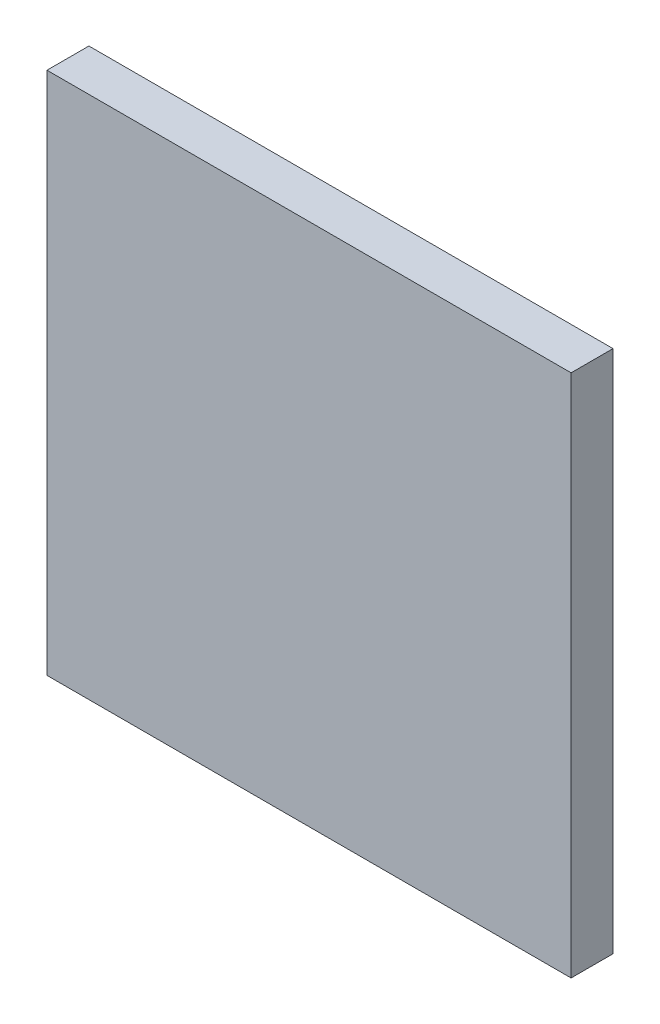
ISO-10303-21;
HEADER;
FILE_DESCRIPTION(('STEP AP214'),'2;1');
FILE_NAME('part.step','',(''),(''),'','','');
FILE_SCHEMA(('AUTOMOTIVE_DESIGN { 1 0 10303 214 1 1 1 1 }'));
ENDSEC;
DATA;
#1=APPLICATION_CONTEXT('core data for automotive mechanical design processes');
#2=APPLICATION_PROTOCOL_DEFINITION('international standard','automotive_design',2000,#1);
#3=PRODUCT_CONTEXT('',#1,'mechanical');
#4=PRODUCT('Part','Part','',(#3));
#5=PRODUCT_RELATED_PRODUCT_CATEGORY('part','',(#4));
#6=PRODUCT_DEFINITION_FORMATION('','',#4);
#7=PRODUCT_DEFINITION_CONTEXT('part definition',#1,'design');
#8=PRODUCT_DEFINITION('design','',#6,#7);
#9=PRODUCT_DEFINITION_SHAPE('','',#8);
#10=(LENGTH_UNIT() NAMED_UNIT(*) SI_UNIT(.MILLI.,.METRE.));
#11=(NAMED_UNIT(*) PLANE_ANGLE_UNIT() SI_UNIT($,.RADIAN.));
#12=(NAMED_UNIT(*) SI_UNIT($,.STERADIAN.) SOLID_ANGLE_UNIT());
#13=UNCERTAINTY_MEASURE_WITH_UNIT(LENGTH_MEASURE(1.E-05),#10,'distance_accuracy_value','');
#14=(GEOMETRIC_REPRESENTATION_CONTEXT(3) GLOBAL_UNCERTAINTY_ASSIGNED_CONTEXT((#13)) GLOBAL_UNIT_ASSIGNED_CONTEXT((#10,
#11,#12)) REPRESENTATION_CONTEXT('',''));
#15=CARTESIAN_POINT('',(0.,0.,0.));
#16=DIRECTION('',(0.,0.,1.));
#17=DIRECTION('',(1.,0.,0.));
#18=AXIS2_PLACEMENT_3D('',#15,#16,#17);
#19=CARTESIAN_POINT('',(0.,0.,4.));
#20=DIRECTION('',(1.,0.,0.));
#21=DIRECTION('',(0.,0.,-1.));
#22=AXIS2_PLACEMENT_3D('',#19,#20,#21);
#23=PLANE('',#22);
#24=DIRECTION('',(0.,-1.,0.));
#25=VECTOR('',#24,1.);
#26=CARTESIAN_POINT('',(0.,0.,0.));
#27=LINE('',#26,#25);
#28=CARTESIAN_POINT('',(0.,50.,0.));
#29=VERTEX_POINT('',#28);
#30=CARTESIAN_POINT('',(0.,0.,0.));
#31=VERTEX_POINT('',#30);
#32=EDGE_CURVE('E98',#29,#31,#27,.T.);
#33=ORIENTED_EDGE('',*,*,#32,.T.);
#34=DIRECTION('',(0.,0.,-1.));
#35=VECTOR('',#34,1.);
#36=CARTESIAN_POINT('',(0.,0.,4.));
#37=LINE('',#36,#35);
#38=CARTESIAN_POINT('',(0.,0.,4.));
#39=VERTEX_POINT('',#38);
#40=EDGE_CURVE('E11',#39,#31,#37,.T.);
#41=ORIENTED_EDGE('',*,*,#40,.F.);
#42=DIRECTION('',(0.,-1.,0.));
#43=VECTOR('',#42,1.);
#44=CARTESIAN_POINT('',(0.,0.,4.));
#45=LINE('',#44,#43);
#46=CARTESIAN_POINT('',(0.,50.,4.));
#47=VERTEX_POINT('',#46);
#48=EDGE_CURVE('E86',#47,#39,#45,.T.);
#49=ORIENTED_EDGE('',*,*,#48,.F.);
#50=DIRECTION('',(0.,0.,-1.));
#51=VECTOR('',#50,1.);
#52=CARTESIAN_POINT('',(0.,50.,4.));
#53=LINE('',#52,#51);
#54=EDGE_CURVE('E94',#47,#29,#53,.T.);
#55=ORIENTED_EDGE('',*,*,#54,.T.);
#56=EDGE_LOOP('',(#33,#41,#49,#55));
#57=FACE_BOUND('',#56,.T.);
#58=ADVANCED_FACE('F35',(#57),#23,.F.);
#59=CARTESIAN_POINT('',(0.,0.,4.));
#60=DIRECTION('',(0.,1.,0.));
#61=DIRECTION('',(0.,0.,1.));
#62=AXIS2_PLACEMENT_3D('',#59,#60,#61);
#63=PLANE('',#62);
#64=DIRECTION('',(1.,0.,0.));
#65=VECTOR('',#64,1.);
#66=CARTESIAN_POINT('',(0.,0.,0.));
#67=LINE('',#66,#65);
#68=CARTESIAN_POINT('',(50.,0.,0.));
#69=VERTEX_POINT('',#68);
#70=EDGE_CURVE('E90',#31,#69,#67,.T.);
#71=ORIENTED_EDGE('',*,*,#70,.T.);
#72=DIRECTION('',(0.,0.,-1.));
#73=VECTOR('',#72,1.);
#74=CARTESIAN_POINT('',(50.,0.,4.));
#75=LINE('',#74,#73);
#76=CARTESIAN_POINT('',(50.,0.,4.));
#77=VERTEX_POINT('',#76);
#78=EDGE_CURVE('E43',#77,#69,#75,.T.);
#79=ORIENTED_EDGE('',*,*,#78,.F.);
#80=DIRECTION('',(1.,0.,0.));
#81=VECTOR('',#80,1.);
#82=CARTESIAN_POINT('',(0.,0.,4.));
#83=LINE('',#82,#81);
#84=EDGE_CURVE('E81',#39,#77,#83,.T.);
#85=ORIENTED_EDGE('',*,*,#84,.F.);
#86=ORIENTED_EDGE('',*,*,#40,.T.);
#87=EDGE_LOOP('',(#71,#79,#85,#86));
#88=FACE_BOUND('',#87,.T.);
#89=ADVANCED_FACE('F89',(#88),#63,.F.);
#90=CARTESIAN_POINT('',(50.,0.,4.));
#91=DIRECTION('',(-1.,0.,0.));
#92=DIRECTION('',(0.,0.,1.));
#93=AXIS2_PLACEMENT_3D('',#90,#91,#92);
#94=PLANE('',#93);
#95=DIRECTION('',(0.,1.,0.));
#96=VECTOR('',#95,1.);
#97=CARTESIAN_POINT('',(50.,0.,0.));
#98=LINE('',#97,#96);
#99=CARTESIAN_POINT('',(50.,50.,0.));
#100=VERTEX_POINT('',#99);
#101=EDGE_CURVE('E68',#69,#100,#98,.T.);
#102=ORIENTED_EDGE('',*,*,#101,.T.);
#103=DIRECTION('',(0.,0.,-1.));
#104=VECTOR('',#103,1.);
#105=CARTESIAN_POINT('',(50.,50.,4.));
#106=LINE('',#105,#104);
#107=CARTESIAN_POINT('',(50.,50.,4.));
#108=VERTEX_POINT('',#107);
#109=EDGE_CURVE('E91',#108,#100,#106,.T.);
#110=ORIENTED_EDGE('',*,*,#109,.F.);
#111=DIRECTION('',(0.,1.,0.));
#112=VECTOR('',#111,1.);
#113=CARTESIAN_POINT('',(50.,0.,4.));
#114=LINE('',#113,#112);
#115=EDGE_CURVE('E84',#77,#108,#114,.T.);
#116=ORIENTED_EDGE('',*,*,#115,.F.);
#117=ORIENTED_EDGE('',*,*,#78,.T.);
#118=EDGE_LOOP('',(#102,#110,#116,#117));
#119=FACE_BOUND('',#118,.T.);
#120=ADVANCED_FACE('F92',(#119),#94,.F.);
#121=CARTESIAN_POINT('',(0.,50.,4.));
#122=DIRECTION('',(0.,-1.,0.));
#123=DIRECTION('',(0.,0.,-1.));
#124=AXIS2_PLACEMENT_3D('',#121,#122,#123);
#125=PLANE('',#124);
#126=DIRECTION('',(-1.,0.,0.));
#127=VECTOR('',#126,1.);
#128=CARTESIAN_POINT('',(0.,50.,0.));
#129=LINE('',#128,#127);
#130=EDGE_CURVE('E74',#100,#29,#129,.T.);
#131=ORIENTED_EDGE('',*,*,#130,.T.);
#132=ORIENTED_EDGE('',*,*,#54,.F.);
#133=DIRECTION('',(-1.,0.,0.));
#134=VECTOR('',#133,1.);
#135=CARTESIAN_POINT('',(0.,50.,4.));
#136=LINE('',#135,#134);
#137=EDGE_CURVE('E51',#108,#47,#136,.T.);
#138=ORIENTED_EDGE('',*,*,#137,.F.);
#139=ORIENTED_EDGE('',*,*,#109,.T.);
#140=EDGE_LOOP('',(#131,#132,#138,#139));
#141=FACE_BOUND('',#140,.T.);
#142=ADVANCED_FACE('F105',(#141),#125,.F.);
#143=CARTESIAN_POINT('',(0.,50.,4.));
#144=DIRECTION('',(0.,0.,-1.));
#145=DIRECTION('',(-1.,0.,0.));
#146=AXIS2_PLACEMENT_3D('',#143,#144,#145);
#147=PLANE('',#146);
#148=ORIENTED_EDGE('',*,*,#48,.T.);
#149=ORIENTED_EDGE('',*,*,#84,.T.);
#150=ORIENTED_EDGE('',*,*,#115,.T.);
#151=ORIENTED_EDGE('',*,*,#137,.T.);
#152=EDGE_LOOP('',(#148,#149,#150,#151));
#153=FACE_BOUND('',#152,.T.);
#154=ADVANCED_FACE('F82',(#153),#147,.F.);
#155=CARTESIAN_POINT('',(0.,50.,0.));
#156=DIRECTION('',(0.,0.,-1.));
#157=DIRECTION('',(-1.,0.,0.));
#158=AXIS2_PLACEMENT_3D('',#155,#156,#157);
#159=PLANE('',#158);
#160=ORIENTED_EDGE('',*,*,#32,.F.);
#161=ORIENTED_EDGE('',*,*,#130,.F.);
#162=ORIENTED_EDGE('',*,*,#101,.F.);
#163=ORIENTED_EDGE('',*,*,#70,.F.);
#164=EDGE_LOOP('',(#160,#161,#162,#163));
#165=FACE_BOUND('',#164,.T.);
#166=ADVANCED_FACE('F108',(#165),#159,.T.);
#167=CLOSED_SHELL('',(#58,#89,#120,#142,#154,#166));
#168=MANIFOLD_SOLID_BREP('B2',#167);
#169=ADVANCED_BREP_SHAPE_REPRESENTATION('',(#18,#168),#14);
#170=SHAPE_DEFINITION_REPRESENTATION(#9,#169);
ENDSEC;
END-ISO-10303-21;
